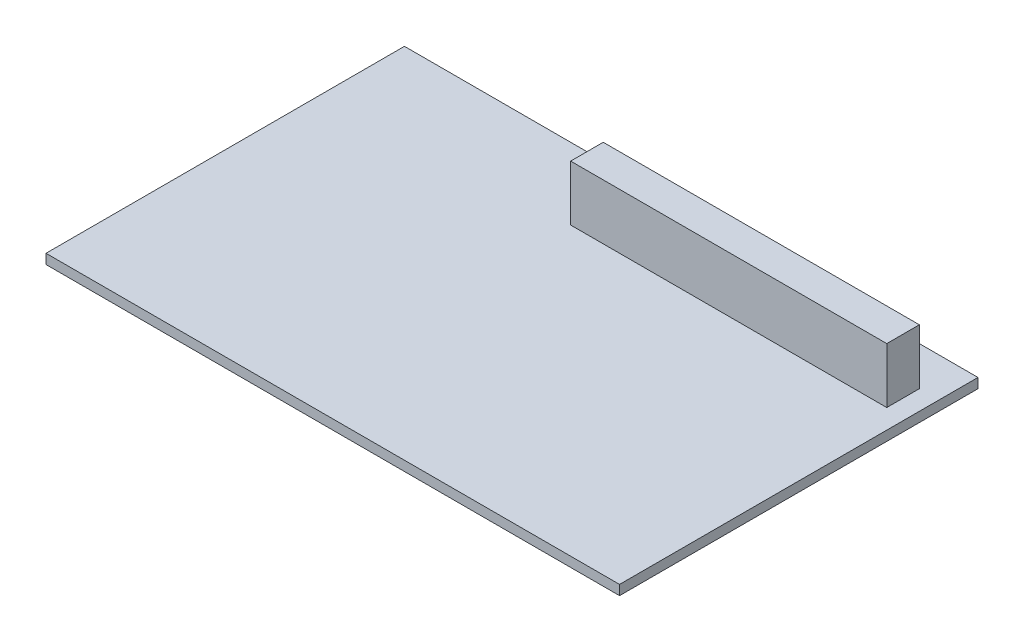
ISO-10303-21;
HEADER;
FILE_DESCRIPTION(('STEP AP214'),'2;1');
FILE_NAME('part.step','',(''),(''),'','','');
FILE_SCHEMA(('AUTOMOTIVE_DESIGN { 1 0 10303 214 1 1 1 1 }'));
ENDSEC;
DATA;
#1=APPLICATION_CONTEXT('core data for automotive mechanical design processes');
#2=APPLICATION_PROTOCOL_DEFINITION('international standard','automotive_design',2000,#1);
#3=PRODUCT_CONTEXT('',#1,'mechanical');
#4=PRODUCT('Part','Part','',(#3));
#5=PRODUCT_RELATED_PRODUCT_CATEGORY('part','',(#4));
#6=PRODUCT_DEFINITION_FORMATION('','',#4);
#7=PRODUCT_DEFINITION_CONTEXT('part definition',#1,'design');
#8=PRODUCT_DEFINITION('design','',#6,#7);
#9=PRODUCT_DEFINITION_SHAPE('','',#8);
#10=(LENGTH_UNIT() NAMED_UNIT(*) SI_UNIT(.MILLI.,.METRE.));
#11=(NAMED_UNIT(*) PLANE_ANGLE_UNIT() SI_UNIT($,.RADIAN.));
#12=(NAMED_UNIT(*) SI_UNIT($,.STERADIAN.) SOLID_ANGLE_UNIT());
#13=UNCERTAINTY_MEASURE_WITH_UNIT(LENGTH_MEASURE(1.E-05),#10,'distance_accuracy_value','');
#14=(GEOMETRIC_REPRESENTATION_CONTEXT(3) GLOBAL_UNCERTAINTY_ASSIGNED_CONTEXT((#13)) GLOBAL_UNIT_ASSIGNED_CONTEXT((#10,
#11,#12)) REPRESENTATION_CONTEXT('',''));
#15=CARTESIAN_POINT('',(0.,0.,0.));
#16=DIRECTION('',(0.,0.,1.));
#17=DIRECTION('',(1.,0.,0.));
#18=AXIS2_PLACEMENT_3D('',#15,#16,#17);
#19=CARTESIAN_POINT('',(0.,1.5,0.));
#20=DIRECTION('',(0.,-1.,0.));
#21=DIRECTION('',(0.,0.,-1.));
#22=AXIS2_PLACEMENT_3D('',#19,#20,#21);
#23=PLANE('',#22);
#24=DIRECTION('',(0.,0.,-1.));
#25=VECTOR('',#24,1.);
#26=CARTESIAN_POINT('',(44.,1.5,27.5));
#27=LINE('',#26,#25);
#28=CARTESIAN_POINT('',(44.,1.5,27.5));
#29=VERTEX_POINT('',#28);
#30=CARTESIAN_POINT('',(44.,1.5,-27.5));
#31=VERTEX_POINT('',#30);
#32=EDGE_CURVE('E128',#29,#31,#27,.T.);
#33=ORIENTED_EDGE('',*,*,#32,.T.);
#34=DIRECTION('',(-1.,0.,0.));
#35=VECTOR('',#34,1.);
#36=CARTESIAN_POINT('',(-44.,1.5,-27.5));
#37=LINE('',#36,#35);
#38=CARTESIAN_POINT('',(-44.,1.5,-27.5));
#39=VERTEX_POINT('',#38);
#40=EDGE_CURVE('E131',#31,#39,#37,.T.);
#41=ORIENTED_EDGE('',*,*,#40,.T.);
#42=DIRECTION('',(0.,0.,1.));
#43=VECTOR('',#42,1.);
#44=CARTESIAN_POINT('',(-44.,1.5,27.5));
#45=LINE('',#44,#43);
#46=CARTESIAN_POINT('',(-44.,1.5,27.5));
#47=VERTEX_POINT('',#46);
#48=EDGE_CURVE('E134',#39,#47,#45,.T.);
#49=ORIENTED_EDGE('',*,*,#48,.T.);
#50=DIRECTION('',(1.,0.,0.));
#51=VECTOR('',#50,1.);
#52=CARTESIAN_POINT('',(-44.,1.5,27.5));
#53=LINE('',#52,#51);
#54=EDGE_CURVE('E136',#47,#29,#53,.T.);
#55=ORIENTED_EDGE('',*,*,#54,.T.);
#56=EDGE_LOOP('',(#33,#41,#49,#55));
#57=FACE_BOUND('',#56,.T.);
#58=DIRECTION('',(0.,0.,1.));
#59=VECTOR('',#58,1.);
#60=CARTESIAN_POINT('',(-7.50000000000001,1.5,-16.5));
#61=LINE('',#60,#59);
#62=CARTESIAN_POINT('',(-7.50000000000001,1.5,-21.5));
#63=VERTEX_POINT('',#62);
#64=CARTESIAN_POINT('',(-7.50000000000001,1.5,-16.5));
#65=VERTEX_POINT('',#64);
#66=EDGE_CURVE('E118',#63,#65,#61,.T.);
#67=ORIENTED_EDGE('',*,*,#66,.F.);
#68=DIRECTION('',(-1.,0.,0.));
#69=VECTOR('',#68,1.);
#70=CARTESIAN_POINT('',(-7.50000000000001,1.5,-21.5));
#71=LINE('',#70,#69);
#72=CARTESIAN_POINT('',(41.,1.5,-21.5));
#73=VERTEX_POINT('',#72);
#74=EDGE_CURVE('E115',#73,#63,#71,.T.);
#75=ORIENTED_EDGE('',*,*,#74,.F.);
#76=DIRECTION('',(0.,0.,-1.));
#77=VECTOR('',#76,1.);
#78=CARTESIAN_POINT('',(41.,1.5,-16.5));
#79=LINE('',#78,#77);
#80=CARTESIAN_POINT('',(41.,1.5,-16.5));
#81=VERTEX_POINT('',#80);
#82=EDGE_CURVE('E53',#81,#73,#79,.T.);
#83=ORIENTED_EDGE('',*,*,#82,.F.);
#84=DIRECTION('',(1.,0.,0.));
#85=VECTOR('',#84,1.);
#86=CARTESIAN_POINT('',(-7.50000000000001,1.5,-16.5));
#87=LINE('',#86,#85);
#88=EDGE_CURVE('E48',#65,#81,#87,.T.);
#89=ORIENTED_EDGE('',*,*,#88,.F.);
#90=EDGE_LOOP('',(#67,#75,#83,#89));
#91=FACE_BOUND('',#90,.T.);
#92=ADVANCED_FACE('F33',(#57,#91),#23,.F.);
#93=CARTESIAN_POINT('',(44.,1.5,27.5));
#94=DIRECTION('',(-1.,0.,0.));
#95=DIRECTION('',(0.,0.,1.));
#96=AXIS2_PLACEMENT_3D('',#93,#94,#95);
#97=PLANE('',#96);
#98=DIRECTION('',(0.,0.,-1.));
#99=VECTOR('',#98,1.);
#100=CARTESIAN_POINT('',(44.,0.,27.5));
#101=LINE('',#100,#99);
#102=CARTESIAN_POINT('',(44.,0.,27.5));
#103=VERTEX_POINT('',#102);
#104=CARTESIAN_POINT('',(44.,0.,-27.5));
#105=VERTEX_POINT('',#104);
#106=EDGE_CURVE('E119',#103,#105,#101,.T.);
#107=ORIENTED_EDGE('',*,*,#106,.T.);
#108=DIRECTION('',(0.,-1.,0.));
#109=VECTOR('',#108,1.);
#110=CARTESIAN_POINT('',(44.,1.5,-27.5));
#111=LINE('',#110,#109);
#112=EDGE_CURVE('E11',#31,#105,#111,.T.);
#113=ORIENTED_EDGE('',*,*,#112,.F.);
#114=ORIENTED_EDGE('',*,*,#32,.F.);
#115=DIRECTION('',(0.,-1.,0.));
#116=VECTOR('',#115,1.);
#117=CARTESIAN_POINT('',(44.,1.5,27.5));
#118=LINE('',#117,#116);
#119=EDGE_CURVE('E137',#29,#103,#118,.T.);
#120=ORIENTED_EDGE('',*,*,#119,.T.);
#121=EDGE_LOOP('',(#107,#113,#114,#120));
#122=FACE_BOUND('',#121,.T.);
#123=ADVANCED_FACE('F35',(#122),#97,.F.);
#124=CARTESIAN_POINT('',(-44.,1.5,-27.5));
#125=DIRECTION('',(0.,0.,1.));
#126=DIRECTION('',(1.,0.,0.));
#127=AXIS2_PLACEMENT_3D('',#124,#125,#126);
#128=PLANE('',#127);
#129=DIRECTION('',(-1.,0.,0.));
#130=VECTOR('',#129,1.);
#131=CARTESIAN_POINT('',(-44.,0.,-27.5));
#132=LINE('',#131,#130);
#133=CARTESIAN_POINT('',(-44.,0.,-27.5));
#134=VERTEX_POINT('',#133);
#135=EDGE_CURVE('E122',#105,#134,#132,.T.);
#136=ORIENTED_EDGE('',*,*,#135,.T.);
#137=DIRECTION('',(0.,-1.,0.));
#138=VECTOR('',#137,1.);
#139=CARTESIAN_POINT('',(-44.,1.5,-27.5));
#140=LINE('',#139,#138);
#141=EDGE_CURVE('E41',#39,#134,#140,.T.);
#142=ORIENTED_EDGE('',*,*,#141,.F.);
#143=ORIENTED_EDGE('',*,*,#40,.F.);
#144=ORIENTED_EDGE('',*,*,#112,.T.);
#145=EDGE_LOOP('',(#136,#142,#143,#144));
#146=FACE_BOUND('',#145,.T.);
#147=ADVANCED_FACE('F167',(#146),#128,.F.);
#148=CARTESIAN_POINT('',(-44.,1.5,27.5));
#149=DIRECTION('',(1.,0.,0.));
#150=DIRECTION('',(0.,0.,-1.));
#151=AXIS2_PLACEMENT_3D('',#148,#149,#150);
#152=PLANE('',#151);
#153=DIRECTION('',(0.,0.,1.));
#154=VECTOR('',#153,1.);
#155=CARTESIAN_POINT('',(-44.,0.,27.5));
#156=LINE('',#155,#154);
#157=CARTESIAN_POINT('',(-44.,0.,27.5));
#158=VERTEX_POINT('',#157);
#159=EDGE_CURVE('E140',#134,#158,#156,.T.);
#160=ORIENTED_EDGE('',*,*,#159,.T.);
#161=DIRECTION('',(0.,-1.,0.));
#162=VECTOR('',#161,1.);
#163=CARTESIAN_POINT('',(-44.,1.5,27.5));
#164=LINE('',#163,#162);
#165=EDGE_CURVE('E145',#47,#158,#164,.T.);
#166=ORIENTED_EDGE('',*,*,#165,.F.);
#167=ORIENTED_EDGE('',*,*,#48,.F.);
#168=ORIENTED_EDGE('',*,*,#141,.T.);
#169=EDGE_LOOP('',(#160,#166,#167,#168));
#170=FACE_BOUND('',#169,.T.);
#171=ADVANCED_FACE('F152',(#170),#152,.F.);
#172=CARTESIAN_POINT('',(-44.,1.5,27.5));
#173=DIRECTION('',(0.,0.,-1.));
#174=DIRECTION('',(-1.,0.,0.));
#175=AXIS2_PLACEMENT_3D('',#172,#173,#174);
#176=PLANE('',#175);
#177=DIRECTION('',(1.,0.,0.));
#178=VECTOR('',#177,1.);
#179=CARTESIAN_POINT('',(-44.,0.,27.5));
#180=LINE('',#179,#178);
#181=EDGE_CURVE('E132',#158,#103,#180,.T.);
#182=ORIENTED_EDGE('',*,*,#181,.T.);
#183=ORIENTED_EDGE('',*,*,#119,.F.);
#184=ORIENTED_EDGE('',*,*,#54,.F.);
#185=ORIENTED_EDGE('',*,*,#165,.T.);
#186=EDGE_LOOP('',(#182,#183,#184,#185));
#187=FACE_BOUND('',#186,.T.);
#188=ADVANCED_FACE('F161',(#187),#176,.F.);
#189=CARTESIAN_POINT('',(0.,0.,0.));
#190=DIRECTION('',(0.,-1.,0.));
#191=DIRECTION('',(0.,0.,-1.));
#192=AXIS2_PLACEMENT_3D('',#189,#190,#191);
#193=PLANE('',#192);
#194=ORIENTED_EDGE('',*,*,#106,.F.);
#195=ORIENTED_EDGE('',*,*,#181,.F.);
#196=ORIENTED_EDGE('',*,*,#159,.F.);
#197=ORIENTED_EDGE('',*,*,#135,.F.);
#198=EDGE_LOOP('',(#194,#195,#196,#197));
#199=FACE_BOUND('',#198,.T.);
#200=ADVANCED_FACE('F158',(#199),#193,.T.);
#201=CARTESIAN_POINT('',(-7.50000000000001,10.,-16.5));
#202=DIRECTION('',(1.,0.,0.));
#203=DIRECTION('',(0.,0.,-1.));
#204=AXIS2_PLACEMENT_3D('',#201,#202,#203);
#205=PLANE('',#204);
#206=ORIENTED_EDGE('',*,*,#66,.T.);
#207=DIRECTION('',(0.,-1.,0.));
#208=VECTOR('',#207,1.);
#209=CARTESIAN_POINT('',(-7.50000000000001,10.,-16.5));
#210=LINE('',#209,#208);
#211=CARTESIAN_POINT('',(-7.50000000000001,10.,-16.5));
#212=VERTEX_POINT('',#211);
#213=EDGE_CURVE('E99',#212,#65,#210,.T.);
#214=ORIENTED_EDGE('',*,*,#213,.F.);
#215=DIRECTION('',(0.,0.,1.));
#216=VECTOR('',#215,1.);
#217=CARTESIAN_POINT('',(-7.50000000000001,10.,-16.5));
#218=LINE('',#217,#216);
#219=CARTESIAN_POINT('',(-7.50000000000001,10.,-21.5));
#220=VERTEX_POINT('',#219);
#221=EDGE_CURVE('E106',#220,#212,#218,.T.);
#222=ORIENTED_EDGE('',*,*,#221,.F.);
#223=DIRECTION('',(0.,-1.,0.));
#224=VECTOR('',#223,1.);
#225=CARTESIAN_POINT('',(-7.50000000000001,10.,-21.5));
#226=LINE('',#225,#224);
#227=EDGE_CURVE('E260',#220,#63,#226,.T.);
#228=ORIENTED_EDGE('',*,*,#227,.T.);
#229=EDGE_LOOP('',(#206,#214,#222,#228));
#230=FACE_BOUND('',#229,.T.);
#231=ADVANCED_FACE('F117',(#230),#205,.F.);
#232=CARTESIAN_POINT('',(-7.50000000000001,10.,-16.5));
#233=DIRECTION('',(0.,0.,-1.));
#234=DIRECTION('',(-1.,0.,0.));
#235=AXIS2_PLACEMENT_3D('',#232,#233,#234);
#236=PLANE('',#235);
#237=ORIENTED_EDGE('',*,*,#88,.T.);
#238=DIRECTION('',(0.,-1.,0.));
#239=VECTOR('',#238,1.);
#240=CARTESIAN_POINT('',(41.,10.,-16.5));
#241=LINE('',#240,#239);
#242=CARTESIAN_POINT('',(41.,10.,-16.5));
#243=VERTEX_POINT('',#242);
#244=EDGE_CURVE('E102',#243,#81,#241,.T.);
#245=ORIENTED_EDGE('',*,*,#244,.F.);
#246=DIRECTION('',(1.,0.,0.));
#247=VECTOR('',#246,1.);
#248=CARTESIAN_POINT('',(-7.50000000000001,10.,-16.5));
#249=LINE('',#248,#247);
#250=EDGE_CURVE('E95',#212,#243,#249,.T.);
#251=ORIENTED_EDGE('',*,*,#250,.F.);
#252=ORIENTED_EDGE('',*,*,#213,.T.);
#253=EDGE_LOOP('',(#237,#245,#251,#252));
#254=FACE_BOUND('',#253,.T.);
#255=ADVANCED_FACE('F97',(#254),#236,.F.);
#256=CARTESIAN_POINT('',(41.,10.,-16.5));
#257=DIRECTION('',(-1.,0.,0.));
#258=DIRECTION('',(0.,0.,1.));
#259=AXIS2_PLACEMENT_3D('',#256,#257,#258);
#260=PLANE('',#259);
#261=ORIENTED_EDGE('',*,*,#82,.T.);
#262=DIRECTION('',(0.,-1.,0.));
#263=VECTOR('',#262,1.);
#264=CARTESIAN_POINT('',(41.,10.,-21.5));
#265=LINE('',#264,#263);
#266=CARTESIAN_POINT('',(41.,10.,-21.5));
#267=VERTEX_POINT('',#266);
#268=EDGE_CURVE('E124',#267,#73,#265,.T.);
#269=ORIENTED_EDGE('',*,*,#268,.F.);
#270=DIRECTION('',(0.,0.,-1.));
#271=VECTOR('',#270,1.);
#272=CARTESIAN_POINT('',(41.,10.,-16.5));
#273=LINE('',#272,#271);
#274=EDGE_CURVE('E105',#243,#267,#273,.T.);
#275=ORIENTED_EDGE('',*,*,#274,.F.);
#276=ORIENTED_EDGE('',*,*,#244,.T.);
#277=EDGE_LOOP('',(#261,#269,#275,#276));
#278=FACE_BOUND('',#277,.T.);
#279=ADVANCED_FACE('F203',(#278),#260,.F.);
#280=CARTESIAN_POINT('',(-7.50000000000001,10.,-21.5));
#281=DIRECTION('',(0.,0.,1.));
#282=DIRECTION('',(1.,0.,0.));
#283=AXIS2_PLACEMENT_3D('',#280,#281,#282);
#284=PLANE('',#283);
#285=ORIENTED_EDGE('',*,*,#74,.T.);
#286=ORIENTED_EDGE('',*,*,#227,.F.);
#287=DIRECTION('',(-1.,0.,0.));
#288=VECTOR('',#287,1.);
#289=CARTESIAN_POINT('',(-7.50000000000001,10.,-21.5));
#290=LINE('',#289,#288);
#291=EDGE_CURVE('E111',#267,#220,#290,.T.);
#292=ORIENTED_EDGE('',*,*,#291,.F.);
#293=ORIENTED_EDGE('',*,*,#268,.T.);
#294=EDGE_LOOP('',(#285,#286,#292,#293));
#295=FACE_BOUND('',#294,.T.);
#296=ADVANCED_FACE('F209',(#295),#284,.F.);
#297=CARTESIAN_POINT('',(0.,10.,0.));
#298=DIRECTION('',(0.,-1.,0.));
#299=DIRECTION('',(0.,0.,-1.));
#300=AXIS2_PLACEMENT_3D('',#297,#298,#299);
#301=PLANE('',#300);
#302=ORIENTED_EDGE('',*,*,#221,.T.);
#303=ORIENTED_EDGE('',*,*,#250,.T.);
#304=ORIENTED_EDGE('',*,*,#274,.T.);
#305=ORIENTED_EDGE('',*,*,#291,.T.);
#306=EDGE_LOOP('',(#302,#303,#304,#305));
#307=FACE_BOUND('',#306,.T.);
#308=ADVANCED_FACE('F109',(#307),#301,.F.);
#309=CLOSED_SHELL('',(#92,#123,#147,#171,#188,#200,#231,#255,#279,#296,#308));
#310=MANIFOLD_SOLID_BREP('B2',#309);
#311=ADVANCED_BREP_SHAPE_REPRESENTATION('',(#18,#310),#14);
#312=SHAPE_DEFINITION_REPRESENTATION(#9,#311);
ENDSEC;
END-ISO-10303-21;
